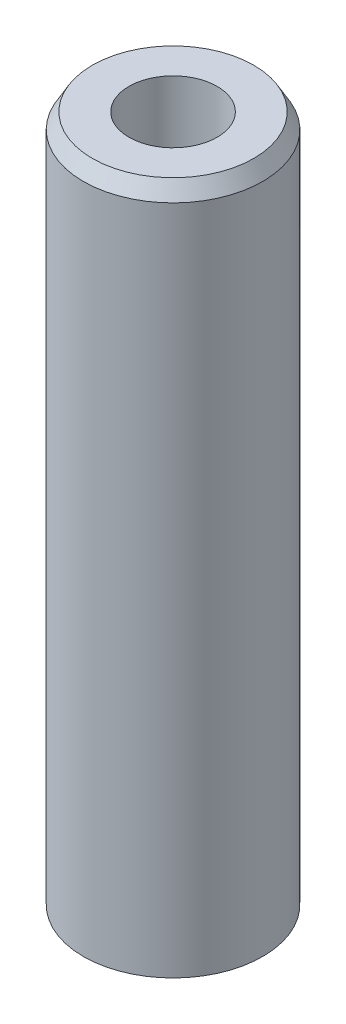
ISO-10303-21;
HEADER;
FILE_DESCRIPTION(('STEP AP214'),'2;1');
FILE_NAME('part.step','',(''),(''),'','','');
FILE_SCHEMA(('AUTOMOTIVE_DESIGN { 1 0 10303 214 1 1 1 1 }'));
ENDSEC;
DATA;
#1=APPLICATION_CONTEXT('core data for automotive mechanical design processes');
#2=APPLICATION_PROTOCOL_DEFINITION('international standard','automotive_design',2000,#1);
#3=PRODUCT_CONTEXT('',#1,'mechanical');
#4=PRODUCT('Part','Part','',(#3));
#5=PRODUCT_RELATED_PRODUCT_CATEGORY('part','',(#4));
#6=PRODUCT_DEFINITION_FORMATION('','',#4);
#7=PRODUCT_DEFINITION_CONTEXT('part definition',#1,'design');
#8=PRODUCT_DEFINITION('design','',#6,#7);
#9=PRODUCT_DEFINITION_SHAPE('','',#8);
#10=(LENGTH_UNIT() NAMED_UNIT(*) SI_UNIT(.MILLI.,.METRE.));
#11=(NAMED_UNIT(*) PLANE_ANGLE_UNIT() SI_UNIT($,.RADIAN.));
#12=(NAMED_UNIT(*) SI_UNIT($,.STERADIAN.) SOLID_ANGLE_UNIT());
#13=UNCERTAINTY_MEASURE_WITH_UNIT(LENGTH_MEASURE(1.E-05),#10,'distance_accuracy_value','');
#14=(GEOMETRIC_REPRESENTATION_CONTEXT(3) GLOBAL_UNCERTAINTY_ASSIGNED_CONTEXT((#13)) GLOBAL_UNIT_ASSIGNED_CONTEXT((#10,
#11,#12)) REPRESENTATION_CONTEXT('',''));
#15=CARTESIAN_POINT('',(0.,0.,0.));
#16=DIRECTION('',(0.,0.,1.));
#17=DIRECTION('',(1.,0.,0.));
#18=AXIS2_PLACEMENT_3D('',#15,#16,#17);
#19=CARTESIAN_POINT('',(0.,58.1724291722426,0.));
#20=DIRECTION('',(0.,-1.,0.));
#21=DIRECTION('',(0.,0.,-1.));
#22=AXIS2_PLACEMENT_3D('',#19,#20,#21);
#23=CYLINDRICAL_SURFACE('',#22,7.5);
#24=CARTESIAN_POINT('',(0.,56.8773898531931,0.));
#25=DIRECTION('',(0.,1.,0.));
#26=DIRECTION('',(0.,0.,1.));
#27=AXIS2_PLACEMENT_3D('',#24,#25,#26);
#28=CIRCLE('',#27,7.5);
#29=CARTESIAN_POINT('',(0.,56.8773898531931,7.5));
#30=VERTEX_POINT('',#29);
#31=EDGE_CURVE('E50',#30,#30,#28,.F.);
#32=ORIENTED_EDGE('',*,*,#31,.T.);
#33=EDGE_LOOP('',(#32));
#34=FACE_BOUND('',#33,.T.);
#35=CARTESIAN_POINT('',(0.,0.747691299464351,0.));
#36=DIRECTION('',(0.,1.,0.));
#37=DIRECTION('',(0.,0.,1.));
#38=AXIS2_PLACEMENT_3D('',#35,#36,#37);
#39=CIRCLE('',#38,7.5);
#40=CARTESIAN_POINT('',(0.,0.747691299464351,7.5));
#41=VERTEX_POINT('',#40);
#42=EDGE_CURVE('E51',#41,#41,#39,.T.);
#43=ORIENTED_EDGE('',*,*,#42,.T.);
#44=EDGE_LOOP('',(#43));
#45=FACE_BOUND('',#44,.T.);
#46=ADVANCED_FACE('F39',(#34,#45),#23,.T.);
#47=CARTESIAN_POINT('',(0.,58.1724291722426,0.));
#48=DIRECTION('',(0.,1.,0.));
#49=DIRECTION('',(0.,0.,1.));
#50=AXIS2_PLACEMENT_3D('',#47,#48,#49);
#51=PLANE('',#50);
#52=CARTESIAN_POINT('',(0.,58.1724291722426,0.));
#53=DIRECTION('',(0.,1.,0.));
#54=DIRECTION('',(0.,0.,1.));
#55=AXIS2_PLACEMENT_3D('',#52,#53,#54);
#56=CIRCLE('',#55,6.75230870053563);
#57=CARTESIAN_POINT('',(0.,58.1724291722426,6.75230870053563));
#58=VERTEX_POINT('',#57);
#59=EDGE_CURVE('E54',#58,#58,#56,.T.);
#60=ORIENTED_EDGE('',*,*,#59,.T.);
#61=EDGE_LOOP('',(#60));
#62=FACE_BOUND('',#61,.T.);
#63=CARTESIAN_POINT('',(0.,58.1724291722426,0.));
#64=DIRECTION('',(0.,1.,0.));
#65=DIRECTION('',(0.,0.,1.));
#66=AXIS2_PLACEMENT_3D('',#63,#64,#65);
#67=CIRCLE('',#66,3.68761622328899);
#68=CARTESIAN_POINT('',(0.,58.1724291722426,3.68761622328899));
#69=VERTEX_POINT('',#68);
#70=EDGE_CURVE('E58',#69,#69,#67,.T.);
#71=ORIENTED_EDGE('',*,*,#70,.F.);
#72=EDGE_LOOP('',(#71));
#73=FACE_BOUND('',#72,.T.);
#74=ADVANCED_FACE('F69',(#62,#73),#51,.T.);
#75=CARTESIAN_POINT('',(0.,0.,0.));
#76=DIRECTION('',(0.,1.,0.));
#77=DIRECTION('',(0.,0.,1.));
#78=AXIS2_PLACEMENT_3D('',#75,#76,#77);
#79=PLANE('',#78);
#80=CARTESIAN_POINT('',(0.,0.,0.));
#81=DIRECTION('',(0.,1.,0.));
#82=DIRECTION('',(0.,0.,1.));
#83=AXIS2_PLACEMENT_3D('',#80,#81,#82);
#84=CIRCLE('',#83,6.20496068095053);
#85=CARTESIAN_POINT('',(0.,0.,6.20496068095053));
#86=VERTEX_POINT('',#85);
#87=EDGE_CURVE('E10',#86,#86,#84,.F.);
#88=ORIENTED_EDGE('',*,*,#87,.T.);
#89=EDGE_LOOP('',(#88));
#90=FACE_BOUND('',#89,.T.);
#91=CARTESIAN_POINT('',(0.,0.,0.));
#92=DIRECTION('',(0.,1.,0.));
#93=DIRECTION('',(0.,0.,1.));
#94=AXIS2_PLACEMENT_3D('',#91,#92,#93);
#95=CIRCLE('',#94,3.68761622328899);
#96=CARTESIAN_POINT('',(0.,0.,3.68761622328899));
#97=VERTEX_POINT('',#96);
#98=EDGE_CURVE('E63',#97,#97,#95,.T.);
#99=ORIENTED_EDGE('',*,*,#98,.T.);
#100=EDGE_LOOP('',(#99));
#101=FACE_BOUND('',#100,.T.);
#102=ADVANCED_FACE('F75',(#90,#101),#79,.F.);
#103=CARTESIAN_POINT('',(0.,58.1724291722426,0.));
#104=DIRECTION('',(0.,-1.,0.));
#105=DIRECTION('',(0.,0.,-1.));
#106=AXIS2_PLACEMENT_3D('',#103,#104,#105);
#107=CYLINDRICAL_SURFACE('',#106,3.68761622328899);
#108=ORIENTED_EDGE('',*,*,#70,.T.);
#109=EDGE_LOOP('',(#108));
#110=FACE_BOUND('',#109,.T.);
#111=ORIENTED_EDGE('',*,*,#98,.F.);
#112=EDGE_LOOP('',(#111));
#113=FACE_BOUND('',#112,.T.);
#114=ADVANCED_FACE('F70',(#110,#113),#107,.F.);
#115=CARTESIAN_POINT('',(0.,58.1724291722426,0.));
#116=DIRECTION('',(0.,-1.,0.));
#117=DIRECTION('',(0.,0.,-1.));
#118=AXIS2_PLACEMENT_3D('',#115,#116,#117);
#119=CONICAL_SURFACE('',#118,6.75230870053563,0.523598775598293);
#120=ORIENTED_EDGE('',*,*,#31,.F.);
#121=EDGE_LOOP('',(#120));
#122=FACE_BOUND('',#121,.T.);
#123=ORIENTED_EDGE('',*,*,#59,.F.);
#124=EDGE_LOOP('',(#123));
#125=FACE_BOUND('',#124,.T.);
#126=ADVANCED_FACE('F81',(#122,#125),#119,.T.);
#127=CARTESIAN_POINT('',(0.,0.747691299464351,0.));
#128=DIRECTION('',(0.,1.,0.));
#129=DIRECTION('',(0.,0.,1.));
#130=AXIS2_PLACEMENT_3D('',#127,#128,#129);
#131=CONICAL_SURFACE('',#130,7.5,1.0471975511966);
#132=CARTESIAN_POINT('',(0.,0.,6.20496068095053));
#133=CARTESIAN_POINT('',(0.,0.00778845103608697,6.2184506738573));
#134=CARTESIAN_POINT('',(0.,0.0155769020721739,6.23194066676406));
#135=CARTESIAN_POINT('',(0.,0.0311538041443478,6.25892065257759));
#136=CARTESIAN_POINT('',(0.,0.0389422551804347,6.27241064548436));
#137=CARTESIAN_POINT('',(0.,0.0545191572526088,6.29939063129789));
#138=CARTESIAN_POINT('',(0.,0.0623076082886959,6.31288062420466));
#139=CARTESIAN_POINT('',(0.,0.0778845103608698,6.33986061001819));
#140=CARTESIAN_POINT('',(0.,0.0856729613969567,6.35335060292495));
#141=CARTESIAN_POINT('',(0.,0.101249863469131,6.38033058873848));
#142=CARTESIAN_POINT('',(0.,0.109038314505218,6.39382058164525));
#143=CARTESIAN_POINT('',(0.,0.124615216577392,6.42080056745878));
#144=CARTESIAN_POINT('',(0.,0.132403667613479,6.43429056036554));
#145=CARTESIAN_POINT('',(0.,0.147980569685653,6.46127054617907));
#146=CARTESIAN_POINT('',(0.,0.15576902072174,6.47476053908584));
#147=CARTESIAN_POINT('',(0.,0.171345922793914,6.50174052489937));
#148=CARTESIAN_POINT('',(0.,0.179134373830001,6.51523051780613));
#149=CARTESIAN_POINT('',(0.,0.194711275902175,6.54221050361966));
#150=CARTESIAN_POINT('',(0.,0.202499726938262,6.55570049652643));
#151=CARTESIAN_POINT('',(0.,0.218076629010436,6.58268048233996));
#152=CARTESIAN_POINT('',(0.,0.225865080046523,6.59617047524673));
#153=CARTESIAN_POINT('',(0.,0.241441982118696,6.62315046106026));
#154=CARTESIAN_POINT('',(0.,0.249230433154784,6.63664045396702));
#155=CARTESIAN_POINT('',(0.,0.264807335226958,6.66362043978055));
#156=CARTESIAN_POINT('',(0.,0.272595786263045,6.67711043268732));
#157=CARTESIAN_POINT('',(0.,0.288172688335218,6.70409041850085));
#158=CARTESIAN_POINT('',(0.,0.295961139371305,6.71758041140761));
#159=CARTESIAN_POINT('',(0.,0.311538041443479,6.74456039722114));
#160=CARTESIAN_POINT('',(0.,0.319326492479567,6.75805039012791));
#161=CARTESIAN_POINT('',(0.,0.33490339455174,6.78503037594144));
#162=CARTESIAN_POINT('',(0.,0.342691845587827,6.79852036884821));
#163=CARTESIAN_POINT('',(0.,0.358268747660001,6.82550035466174));
#164=CARTESIAN_POINT('',(0.,0.366057198696088,6.8389903475685));
#165=CARTESIAN_POINT('',(0.,0.381634100768262,6.86597033338203));
#166=CARTESIAN_POINT('',(0.,0.389422551804349,6.8794603262888));
#167=CARTESIAN_POINT('',(0.,0.404999453876523,6.90644031210233));
#168=CARTESIAN_POINT('',(0.,0.41278790491261,6.91993030500909));
#169=CARTESIAN_POINT('',(0.,0.428364806984784,6.94691029082262));
#170=CARTESIAN_POINT('',(0.,0.436153258020871,6.96040028372939));
#171=CARTESIAN_POINT('',(0.,0.451730160093045,6.98738026954292));
#172=CARTESIAN_POINT('',(0.,0.459518611129132,7.00087026244968));
#173=CARTESIAN_POINT('',(0.,0.475095513201306,7.02785024826322));
#174=CARTESIAN_POINT('',(0.,0.482883964237393,7.04134024116998));
#175=CARTESIAN_POINT('',(0.,0.498460866309567,7.06832022698351));
#176=CARTESIAN_POINT('',(0.,0.506249317345654,7.08181021989028));
#177=CARTESIAN_POINT('',(0.,0.521826219417828,7.10879020570381));
#178=CARTESIAN_POINT('',(0.,0.529614670453915,7.12228019861057));
#179=CARTESIAN_POINT('',(0.,0.545191572526089,7.1492601844241));
#180=CARTESIAN_POINT('',(0.,0.552980023562176,7.16275017733087));
#181=CARTESIAN_POINT('',(0.,0.56855692563435,7.1897301631444));
#182=CARTESIAN_POINT('',(0.,0.576345376670437,7.20322015605116));
#183=CARTESIAN_POINT('',(0.,0.591922278742611,7.23020014186469));
#184=CARTESIAN_POINT('',(0.,0.599710729778698,7.24369013477146));
#185=CARTESIAN_POINT('',(0.,0.615287631850872,7.27067012058499));
#186=CARTESIAN_POINT('',(0.,0.623076082886959,7.28416011349176));
#187=CARTESIAN_POINT('',(0.,0.638652984959133,7.31114009930529));
#188=CARTESIAN_POINT('',(0.,0.64644143599522,7.32463009221205));
#189=CARTESIAN_POINT('',(0.,0.662018338067394,7.35161007802558));
#190=CARTESIAN_POINT('',(0.,0.669806789103481,7.36510007093235));
#191=CARTESIAN_POINT('',(0.,0.685383691175655,7.39208005674588));
#192=CARTESIAN_POINT('',(0.,0.693172142211742,7.40557004965264));
#193=CARTESIAN_POINT('',(0.,0.708749044283916,7.43255003546617));
#194=CARTESIAN_POINT('',(0.,0.716537495320003,7.44604002837294));
#195=CARTESIAN_POINT('',(0.,0.732114397392177,7.47302001418647));
#196=CARTESIAN_POINT('',(0.,0.739902848428264,7.48651000709323));
#197=CARTESIAN_POINT('',(0.,0.747691299464351,7.5));
#198=B_SPLINE_CURVE_WITH_KNOTS('',3,(#132,#133,#134,#135,#136,#137,#138,#139,#140,#141,#142,
#143,#144,#145,#146,#147,#148,#149,#150,#151,#152,#153,#154,#155,#156,#157,#158,#159,#160,#161,
#162,#163,#164,#165,#166,#167,#168,#169,#170,#171,#172,#173,#174,#175,#176,#177,#178,#179,#180,
#181,#182,#183,#184,#185,#186,#187,#188,#189,#190,#191,#192,#193,#194,#195,#196,#197),
.UNSPECIFIED.,.F.,.F.,(4,2,2,2,2,2,2,2,2,2,2,2,2,2,2,2,2,2,2,2,2,2,2,2,2,2,2,2,2,2,2,2,4),(0.,
0.0467307062165227,0.0934614124330453,0.140192118649567,0.18692282486609,0.233653531082612,
0.280384237299134,0.327114943515656,0.373845649732179,0.420576355948701,0.467307062165224,
0.514037768381745,0.560768474598268,0.607499180814791,0.654229887031313,0.700960593247835,
0.747691299464357,0.79442200568088,0.841152711897402,0.887883418113925,0.934614124330447,
0.981344830546969,1.02807553676349,1.07480624298001,1.12153694919654,1.16826765541306,
1.21499836162958,1.2617290678461,1.30845977406263,1.35519048027915,1.40192118649567,
1.44865189271219,1.49538259892871),.UNSPECIFIED.);
#199=EDGE_CURVE('BSEAM45',#86,#41,#198,.T.);
#200=ORIENTED_EDGE('',*,*,#87,.F.);
#201=ORIENTED_EDGE('',*,*,#42,.F.);
#202=ORIENTED_EDGE('',*,*,#199,.T.);
#203=ORIENTED_EDGE('',*,*,#199,.F.);
#204=EDGE_LOOP('',(#200,#202,#201,#203));
#205=FACE_BOUND('',#204,.T.);
#206=ADVANCED_FACE('F45',(#205),#131,.T.);
#207=CLOSED_SHELL('',(#46,#74,#102,#114,#126,#206));
#208=MANIFOLD_SOLID_BREP('B2',#207);
#209=ADVANCED_BREP_SHAPE_REPRESENTATION('',(#18,#208),#14);
#210=SHAPE_DEFINITION_REPRESENTATION(#9,#209);
ENDSEC;
END-ISO-10303-21;
